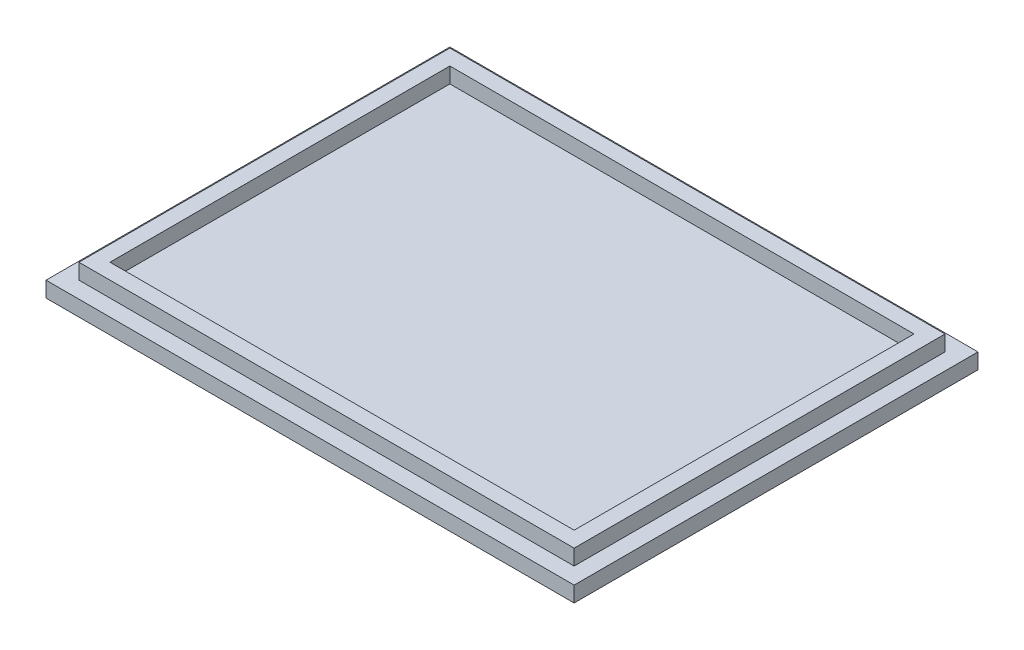
ISO-10303-21;
HEADER;
FILE_DESCRIPTION(('STEP AP214'),'2;1');
FILE_NAME('part.step','',(''),(''),'','','');
FILE_SCHEMA(('AUTOMOTIVE_DESIGN { 1 0 10303 214 1 1 1 1 }'));
ENDSEC;
DATA;
#1=APPLICATION_CONTEXT('core data for automotive mechanical design processes');
#2=APPLICATION_PROTOCOL_DEFINITION('international standard','automotive_design',2000,#1);
#3=PRODUCT_CONTEXT('',#1,'mechanical');
#4=PRODUCT('Part','Part','',(#3));
#5=PRODUCT_RELATED_PRODUCT_CATEGORY('part','',(#4));
#6=PRODUCT_DEFINITION_FORMATION('','',#4);
#7=PRODUCT_DEFINITION_CONTEXT('part definition',#1,'design');
#8=PRODUCT_DEFINITION('design','',#6,#7);
#9=PRODUCT_DEFINITION_SHAPE('','',#8);
#10=(LENGTH_UNIT() NAMED_UNIT(*) SI_UNIT(.MILLI.,.METRE.));
#11=(NAMED_UNIT(*) PLANE_ANGLE_UNIT() SI_UNIT($,.RADIAN.));
#12=(NAMED_UNIT(*) SI_UNIT($,.STERADIAN.) SOLID_ANGLE_UNIT());
#13=UNCERTAINTY_MEASURE_WITH_UNIT(LENGTH_MEASURE(1.E-05),#10,'distance_accuracy_value','');
#14=(GEOMETRIC_REPRESENTATION_CONTEXT(3) GLOBAL_UNCERTAINTY_ASSIGNED_CONTEXT((#13)) GLOBAL_UNIT_ASSIGNED_CONTEXT((#10,
#11,#12)) REPRESENTATION_CONTEXT('',''));
#15=CARTESIAN_POINT('',(0.,0.,0.));
#16=DIRECTION('',(0.,0.,1.));
#17=DIRECTION('',(1.,0.,0.));
#18=AXIS2_PLACEMENT_3D('',#15,#16,#17);
#19=CARTESIAN_POINT('',(0.,5.,0.));
#20=DIRECTION('',(0.,-1.,0.));
#21=DIRECTION('',(0.,0.,-1.));
#22=AXIS2_PLACEMENT_3D('',#19,#20,#21);
#23=PLANE('',#22);
#24=DIRECTION('',(0.,0.,-1.));
#25=VECTOR('',#24,1.);
#26=CARTESIAN_POINT('',(39.85,5.,29.85));
#27=LINE('',#26,#25);
#28=CARTESIAN_POINT('',(39.85,5.,29.85));
#29=VERTEX_POINT('',#28);
#30=CARTESIAN_POINT('',(39.85,5.,-29.85));
#31=VERTEX_POINT('',#30);
#32=EDGE_CURVE('E176',#29,#31,#27,.T.);
#33=ORIENTED_EDGE('',*,*,#32,.T.);
#34=DIRECTION('',(-1.,0.,0.));
#35=VECTOR('',#34,1.);
#36=CARTESIAN_POINT('',(-39.85,5.,-29.85));
#37=LINE('',#36,#35);
#38=CARTESIAN_POINT('',(-39.85,5.,-29.85));
#39=VERTEX_POINT('',#38);
#40=EDGE_CURVE('E180',#31,#39,#37,.T.);
#41=ORIENTED_EDGE('',*,*,#40,.T.);
#42=DIRECTION('',(0.,0.,1.));
#43=VECTOR('',#42,1.);
#44=CARTESIAN_POINT('',(-39.85,5.,29.85));
#45=LINE('',#44,#43);
#46=CARTESIAN_POINT('',(-39.85,5.,29.85));
#47=VERTEX_POINT('',#46);
#48=EDGE_CURVE('E184',#39,#47,#45,.T.);
#49=ORIENTED_EDGE('',*,*,#48,.T.);
#50=DIRECTION('',(1.,0.,0.));
#51=VECTOR('',#50,1.);
#52=CARTESIAN_POINT('',(-39.85,5.,29.85));
#53=LINE('',#52,#51);
#54=EDGE_CURVE('E187',#47,#29,#53,.T.);
#55=ORIENTED_EDGE('',*,*,#54,.T.);
#56=EDGE_LOOP('',(#33,#41,#49,#55));
#57=FACE_BOUND('',#56,.T.);
#58=DIRECTION('',(0.,0.,-1.));
#59=VECTOR('',#58,1.);
#60=CARTESIAN_POINT('',(37.35,5.,0.));
#61=LINE('',#60,#59);
#62=CARTESIAN_POINT('',(37.35,5.,27.35));
#63=VERTEX_POINT('',#62);
#64=CARTESIAN_POINT('',(37.35,5.,-27.35));
#65=VERTEX_POINT('',#64);
#66=EDGE_CURVE('E130',#63,#65,#61,.T.);
#67=ORIENTED_EDGE('',*,*,#66,.F.);
#68=DIRECTION('',(1.,0.,0.));
#69=VECTOR('',#68,1.);
#70=CARTESIAN_POINT('',(0.,5.,27.35));
#71=LINE('',#70,#69);
#72=CARTESIAN_POINT('',(-37.35,5.,27.35));
#73=VERTEX_POINT('',#72);
#74=EDGE_CURVE('E159',#73,#63,#71,.T.);
#75=ORIENTED_EDGE('',*,*,#74,.F.);
#76=DIRECTION('',(0.,0.,1.));
#77=VECTOR('',#76,1.);
#78=CARTESIAN_POINT('',(-37.35,5.,0.));
#79=LINE('',#78,#77);
#80=CARTESIAN_POINT('',(-37.35,5.,-27.35));
#81=VERTEX_POINT('',#80);
#82=EDGE_CURVE('E155',#81,#73,#79,.T.);
#83=ORIENTED_EDGE('',*,*,#82,.F.);
#84=DIRECTION('',(-1.,0.,0.));
#85=VECTOR('',#84,1.);
#86=CARTESIAN_POINT('',(0.,5.,-27.35));
#87=LINE('',#86,#85);
#88=EDGE_CURVE('E141',#65,#81,#87,.T.);
#89=ORIENTED_EDGE('',*,*,#88,.F.);
#90=EDGE_LOOP('',(#67,#75,#83,#89));
#91=FACE_BOUND('',#90,.T.);
#92=ADVANCED_FACE('F39',(#57,#91),#23,.F.);
#93=CARTESIAN_POINT('',(0.,2.5,0.));
#94=DIRECTION('',(0.,-1.,0.));
#95=DIRECTION('',(0.,0.,-1.));
#96=AXIS2_PLACEMENT_3D('',#93,#94,#95);
#97=PLANE('',#96);
#98=DIRECTION('',(0.,0.,-1.));
#99=VECTOR('',#98,1.);
#100=CARTESIAN_POINT('',(42.5,2.5,32.5));
#101=LINE('',#100,#99);
#102=CARTESIAN_POINT('',(42.5,2.5,32.5));
#103=VERTEX_POINT('',#102);
#104=CARTESIAN_POINT('',(42.5,2.5,-32.5));
#105=VERTEX_POINT('',#104);
#106=EDGE_CURVE('E219',#103,#105,#101,.T.);
#107=ORIENTED_EDGE('',*,*,#106,.T.);
#108=DIRECTION('',(-1.,0.,0.));
#109=VECTOR('',#108,1.);
#110=CARTESIAN_POINT('',(-42.5,2.5,-32.5));
#111=LINE('',#110,#109);
#112=CARTESIAN_POINT('',(-42.5,2.5,-32.5));
#113=VERTEX_POINT('',#112);
#114=EDGE_CURVE('E223',#105,#113,#111,.T.);
#115=ORIENTED_EDGE('',*,*,#114,.T.);
#116=DIRECTION('',(0.,0.,1.));
#117=VECTOR('',#116,1.);
#118=CARTESIAN_POINT('',(-42.5,2.5,32.5));
#119=LINE('',#118,#117);
#120=CARTESIAN_POINT('',(-42.5,2.5,32.5));
#121=VERTEX_POINT('',#120);
#122=EDGE_CURVE('E227',#113,#121,#119,.T.);
#123=ORIENTED_EDGE('',*,*,#122,.T.);
#124=DIRECTION('',(1.,0.,0.));
#125=VECTOR('',#124,1.);
#126=CARTESIAN_POINT('',(-42.5,2.5,32.5));
#127=LINE('',#126,#125);
#128=EDGE_CURVE('E230',#121,#103,#127,.T.);
#129=ORIENTED_EDGE('',*,*,#128,.T.);
#130=EDGE_LOOP('',(#107,#115,#123,#129));
#131=FACE_BOUND('',#130,.T.);
#132=DIRECTION('',(0.,0.,-1.));
#133=VECTOR('',#132,1.);
#134=CARTESIAN_POINT('',(39.85,2.5,29.85));
#135=LINE('',#134,#133);
#136=CARTESIAN_POINT('',(39.85,2.5,29.85));
#137=VERTEX_POINT('',#136);
#138=CARTESIAN_POINT('',(39.85,2.5,-29.85));
#139=VERTEX_POINT('',#138);
#140=EDGE_CURVE('E63',#137,#139,#135,.T.);
#141=ORIENTED_EDGE('',*,*,#140,.F.);
#142=DIRECTION('',(1.,0.,0.));
#143=VECTOR('',#142,1.);
#144=CARTESIAN_POINT('',(-39.85,2.5,29.85));
#145=LINE('',#144,#143);
#146=CARTESIAN_POINT('',(-39.85,2.5,29.85));
#147=VERTEX_POINT('',#146);
#148=EDGE_CURVE('E181',#147,#137,#145,.T.);
#149=ORIENTED_EDGE('',*,*,#148,.F.);
#150=DIRECTION('',(0.,0.,1.));
#151=VECTOR('',#150,1.);
#152=CARTESIAN_POINT('',(-39.85,2.5,29.85));
#153=LINE('',#152,#151);
#154=CARTESIAN_POINT('',(-39.85,2.5,-29.85));
#155=VERTEX_POINT('',#154);
#156=EDGE_CURVE('E197',#155,#147,#153,.T.);
#157=ORIENTED_EDGE('',*,*,#156,.F.);
#158=DIRECTION('',(-1.,0.,0.));
#159=VECTOR('',#158,1.);
#160=CARTESIAN_POINT('',(-39.85,2.5,-29.85));
#161=LINE('',#160,#159);
#162=EDGE_CURVE('E193',#139,#155,#161,.T.);
#163=ORIENTED_EDGE('',*,*,#162,.F.);
#164=EDGE_LOOP('',(#141,#149,#157,#163));
#165=FACE_BOUND('',#164,.T.);
#166=ADVANCED_FACE('F272',(#131,#165),#97,.F.);
#167=CARTESIAN_POINT('',(42.5,2.5,32.5));
#168=DIRECTION('',(-1.,0.,0.));
#169=DIRECTION('',(0.,0.,1.));
#170=AXIS2_PLACEMENT_3D('',#167,#168,#169);
#171=PLANE('',#170);
#172=DIRECTION('',(0.,0.,-1.));
#173=VECTOR('',#172,1.);
#174=CARTESIAN_POINT('',(42.5,0.,32.5));
#175=LINE('',#174,#173);
#176=CARTESIAN_POINT('',(42.5,0.,32.5));
#177=VERTEX_POINT('',#176);
#178=CARTESIAN_POINT('',(42.5,0.,-32.5));
#179=VERTEX_POINT('',#178);
#180=EDGE_CURVE('E218',#177,#179,#175,.T.);
#181=ORIENTED_EDGE('',*,*,#180,.T.);
#182=DIRECTION('',(0.,-1.,0.));
#183=VECTOR('',#182,1.);
#184=CARTESIAN_POINT('',(42.5,2.5,-32.5));
#185=LINE('',#184,#183);
#186=EDGE_CURVE('E11',#105,#179,#185,.T.);
#187=ORIENTED_EDGE('',*,*,#186,.F.);
#188=ORIENTED_EDGE('',*,*,#106,.F.);
#189=DIRECTION('',(0.,-1.,0.));
#190=VECTOR('',#189,1.);
#191=CARTESIAN_POINT('',(42.5,2.5,32.5));
#192=LINE('',#191,#190);
#193=EDGE_CURVE('E233',#103,#177,#192,.T.);
#194=ORIENTED_EDGE('',*,*,#193,.T.);
#195=EDGE_LOOP('',(#181,#187,#188,#194));
#196=FACE_BOUND('',#195,.T.);
#197=ADVANCED_FACE('F41',(#196),#171,.F.);
#198=CARTESIAN_POINT('',(-42.5,2.5,-32.5));
#199=DIRECTION('',(0.,0.,1.));
#200=DIRECTION('',(1.,0.,0.));
#201=AXIS2_PLACEMENT_3D('',#198,#199,#200);
#202=PLANE('',#201);
#203=DIRECTION('',(-1.,0.,0.));
#204=VECTOR('',#203,1.);
#205=CARTESIAN_POINT('',(-42.5,0.,-32.5));
#206=LINE('',#205,#204);
#207=CARTESIAN_POINT('',(-42.5,0.,-32.5));
#208=VERTEX_POINT('',#207);
#209=EDGE_CURVE('E237',#179,#208,#206,.T.);
#210=ORIENTED_EDGE('',*,*,#209,.T.);
#211=DIRECTION('',(0.,-1.,0.));
#212=VECTOR('',#211,1.);
#213=CARTESIAN_POINT('',(-42.5,2.5,-32.5));
#214=LINE('',#213,#212);
#215=EDGE_CURVE('E48',#113,#208,#214,.T.);
#216=ORIENTED_EDGE('',*,*,#215,.F.);
#217=ORIENTED_EDGE('',*,*,#114,.F.);
#218=ORIENTED_EDGE('',*,*,#186,.T.);
#219=EDGE_LOOP('',(#210,#216,#217,#218));
#220=FACE_BOUND('',#219,.T.);
#221=ADVANCED_FACE('F273',(#220),#202,.F.);
#222=CARTESIAN_POINT('',(-42.5,2.5,32.5));
#223=DIRECTION('',(1.,0.,0.));
#224=DIRECTION('',(0.,0.,-1.));
#225=AXIS2_PLACEMENT_3D('',#222,#223,#224);
#226=PLANE('',#225);
#227=DIRECTION('',(0.,0.,1.));
#228=VECTOR('',#227,1.);
#229=CARTESIAN_POINT('',(-42.5,0.,32.5));
#230=LINE('',#229,#228);
#231=CARTESIAN_POINT('',(-42.5,0.,32.5));
#232=VERTEX_POINT('',#231);
#233=EDGE_CURVE('E240',#208,#232,#230,.T.);
#234=ORIENTED_EDGE('',*,*,#233,.T.);
#235=DIRECTION('',(0.,-1.,0.));
#236=VECTOR('',#235,1.);
#237=CARTESIAN_POINT('',(-42.5,2.5,32.5));
#238=LINE('',#237,#236);
#239=EDGE_CURVE('E248',#121,#232,#238,.T.);
#240=ORIENTED_EDGE('',*,*,#239,.F.);
#241=ORIENTED_EDGE('',*,*,#122,.F.);
#242=ORIENTED_EDGE('',*,*,#215,.T.);
#243=EDGE_LOOP('',(#234,#240,#241,#242));
#244=FACE_BOUND('',#243,.T.);
#245=ADVANCED_FACE('F257',(#244),#226,.F.);
#246=CARTESIAN_POINT('',(-42.5,2.5,32.5));
#247=DIRECTION('',(0.,0.,-1.));
#248=DIRECTION('',(-1.,0.,0.));
#249=AXIS2_PLACEMENT_3D('',#246,#247,#248);
#250=PLANE('',#249);
#251=DIRECTION('',(1.,0.,0.));
#252=VECTOR('',#251,1.);
#253=CARTESIAN_POINT('',(-42.5,0.,32.5));
#254=LINE('',#253,#252);
#255=EDGE_CURVE('E224',#232,#177,#254,.T.);
#256=ORIENTED_EDGE('',*,*,#255,.T.);
#257=ORIENTED_EDGE('',*,*,#193,.F.);
#258=ORIENTED_EDGE('',*,*,#128,.F.);
#259=ORIENTED_EDGE('',*,*,#239,.T.);
#260=EDGE_LOOP('',(#256,#257,#258,#259));
#261=FACE_BOUND('',#260,.T.);
#262=ADVANCED_FACE('F266',(#261),#250,.F.);
#263=CARTESIAN_POINT('',(0.,0.,0.));
#264=DIRECTION('',(0.,-1.,0.));
#265=DIRECTION('',(0.,0.,-1.));
#266=AXIS2_PLACEMENT_3D('',#263,#264,#265);
#267=PLANE('',#266);
#268=ORIENTED_EDGE('',*,*,#180,.F.);
#269=ORIENTED_EDGE('',*,*,#255,.F.);
#270=ORIENTED_EDGE('',*,*,#233,.F.);
#271=ORIENTED_EDGE('',*,*,#209,.F.);
#272=EDGE_LOOP('',(#268,#269,#270,#271));
#273=FACE_BOUND('',#272,.T.);
#274=ADVANCED_FACE('F263',(#273),#267,.T.);
#275=CARTESIAN_POINT('',(39.85,5.,29.85));
#276=DIRECTION('',(-1.,0.,0.));
#277=DIRECTION('',(0.,0.,1.));
#278=AXIS2_PLACEMENT_3D('',#275,#276,#277);
#279=PLANE('',#278);
#280=ORIENTED_EDGE('',*,*,#140,.T.);
#281=DIRECTION('',(0.,-1.,0.));
#282=VECTOR('',#281,1.);
#283=CARTESIAN_POINT('',(39.85,5.,-29.85));
#284=LINE('',#283,#282);
#285=EDGE_CURVE('E214',#31,#139,#284,.T.);
#286=ORIENTED_EDGE('',*,*,#285,.F.);
#287=ORIENTED_EDGE('',*,*,#32,.F.);
#288=DIRECTION('',(0.,-1.,0.));
#289=VECTOR('',#288,1.);
#290=CARTESIAN_POINT('',(39.85,5.,29.85));
#291=LINE('',#290,#289);
#292=EDGE_CURVE('E190',#29,#137,#291,.T.);
#293=ORIENTED_EDGE('',*,*,#292,.T.);
#294=EDGE_LOOP('',(#280,#286,#287,#293));
#295=FACE_BOUND('',#294,.T.);
#296=ADVANCED_FACE('F302',(#295),#279,.F.);
#297=CARTESIAN_POINT('',(-39.85,5.,-29.85));
#298=DIRECTION('',(0.,0.,1.));
#299=DIRECTION('',(1.,0.,0.));
#300=AXIS2_PLACEMENT_3D('',#297,#298,#299);
#301=PLANE('',#300);
#302=ORIENTED_EDGE('',*,*,#162,.T.);
#303=DIRECTION('',(0.,-1.,0.));
#304=VECTOR('',#303,1.);
#305=CARTESIAN_POINT('',(-39.85,5.,-29.85));
#306=LINE('',#305,#304);
#307=EDGE_CURVE('E210',#39,#155,#306,.T.);
#308=ORIENTED_EDGE('',*,*,#307,.F.);
#309=ORIENTED_EDGE('',*,*,#40,.F.);
#310=ORIENTED_EDGE('',*,*,#285,.T.);
#311=EDGE_LOOP('',(#302,#308,#309,#310));
#312=FACE_BOUND('',#311,.T.);
#313=ADVANCED_FACE('F298',(#312),#301,.F.);
#314=CARTESIAN_POINT('',(-39.85,5.,29.85));
#315=DIRECTION('',(1.,0.,0.));
#316=DIRECTION('',(0.,0.,-1.));
#317=AXIS2_PLACEMENT_3D('',#314,#315,#316);
#318=PLANE('',#317);
#319=ORIENTED_EDGE('',*,*,#156,.T.);
#320=DIRECTION('',(0.,-1.,0.));
#321=VECTOR('',#320,1.);
#322=CARTESIAN_POINT('',(-39.85,5.,29.85));
#323=LINE('',#322,#321);
#324=EDGE_CURVE('E206',#47,#147,#323,.T.);
#325=ORIENTED_EDGE('',*,*,#324,.F.);
#326=ORIENTED_EDGE('',*,*,#48,.F.);
#327=ORIENTED_EDGE('',*,*,#307,.T.);
#328=EDGE_LOOP('',(#319,#325,#326,#327));
#329=FACE_BOUND('',#328,.T.);
#330=ADVANCED_FACE('F294',(#329),#318,.F.);
#331=CARTESIAN_POINT('',(-39.85,5.,29.85));
#332=DIRECTION('',(0.,0.,-1.));
#333=DIRECTION('',(-1.,0.,0.));
#334=AXIS2_PLACEMENT_3D('',#331,#332,#333);
#335=PLANE('',#334);
#336=ORIENTED_EDGE('',*,*,#148,.T.);
#337=ORIENTED_EDGE('',*,*,#292,.F.);
#338=ORIENTED_EDGE('',*,*,#54,.F.);
#339=ORIENTED_EDGE('',*,*,#324,.T.);
#340=EDGE_LOOP('',(#336,#337,#338,#339));
#341=FACE_BOUND('',#340,.T.);
#342=ADVANCED_FACE('F291',(#341),#335,.F.);
#343=CARTESIAN_POINT('',(-39.85,5.,-27.35));
#344=DIRECTION('',(0.,0.,1.));
#345=DIRECTION('',(1.,0.,0.));
#346=AXIS2_PLACEMENT_3D('',#343,#344,#345);
#347=PLANE('',#346);
#348=DIRECTION('',(0.,-1.,0.));
#349=VECTOR('',#348,1.);
#350=CARTESIAN_POINT('',(37.35,5.,-27.35));
#351=LINE('',#350,#349);
#352=CARTESIAN_POINT('',(37.35,2.5,-27.35));
#353=VERTEX_POINT('',#352);
#354=EDGE_CURVE('E134',#65,#353,#351,.T.);
#355=ORIENTED_EDGE('',*,*,#354,.F.);
#356=ORIENTED_EDGE('',*,*,#88,.T.);
#357=DIRECTION('',(0.,-1.,0.));
#358=VECTOR('',#357,1.);
#359=CARTESIAN_POINT('',(-37.35,5.,-27.35));
#360=LINE('',#359,#358);
#361=CARTESIAN_POINT('',(-37.35,2.5,-27.35));
#362=VERTEX_POINT('',#361);
#363=EDGE_CURVE('E152',#81,#362,#360,.T.);
#364=ORIENTED_EDGE('',*,*,#363,.T.);
#365=DIRECTION('',(-1.,0.,0.));
#366=VECTOR('',#365,1.);
#367=CARTESIAN_POINT('',(0.,2.5,-27.35));
#368=LINE('',#367,#366);
#369=EDGE_CURVE('E148',#353,#362,#368,.T.);
#370=ORIENTED_EDGE('',*,*,#369,.F.);
#371=EDGE_LOOP('',(#355,#356,#364,#370));
#372=FACE_BOUND('',#371,.T.);
#373=ADVANCED_FACE('F144',(#372),#347,.T.);
#374=CARTESIAN_POINT('',(-37.35,5.,29.85));
#375=DIRECTION('',(1.,0.,0.));
#376=DIRECTION('',(0.,0.,-1.));
#377=AXIS2_PLACEMENT_3D('',#374,#375,#376);
#378=PLANE('',#377);
#379=ORIENTED_EDGE('',*,*,#363,.F.);
#380=ORIENTED_EDGE('',*,*,#82,.T.);
#381=DIRECTION('',(0.,-1.,0.));
#382=VECTOR('',#381,1.);
#383=CARTESIAN_POINT('',(-37.35,5.,27.35));
#384=LINE('',#383,#382);
#385=CARTESIAN_POINT('',(-37.35,2.5,27.35));
#386=VERTEX_POINT('',#385);
#387=EDGE_CURVE('E55',#73,#386,#384,.T.);
#388=ORIENTED_EDGE('',*,*,#387,.T.);
#389=DIRECTION('',(0.,0.,1.));
#390=VECTOR('',#389,1.);
#391=CARTESIAN_POINT('',(-37.35,2.5,0.));
#392=LINE('',#391,#390);
#393=EDGE_CURVE('E170',#362,#386,#392,.T.);
#394=ORIENTED_EDGE('',*,*,#393,.F.);
#395=EDGE_LOOP('',(#379,#380,#388,#394));
#396=FACE_BOUND('',#395,.T.);
#397=ADVANCED_FACE('F341',(#396),#378,.T.);
#398=CARTESIAN_POINT('',(-39.85,5.,27.35));
#399=DIRECTION('',(0.,0.,-1.));
#400=DIRECTION('',(-1.,0.,0.));
#401=AXIS2_PLACEMENT_3D('',#398,#399,#400);
#402=PLANE('',#401);
#403=ORIENTED_EDGE('',*,*,#387,.F.);
#404=ORIENTED_EDGE('',*,*,#74,.T.);
#405=DIRECTION('',(0.,-1.,0.));
#406=VECTOR('',#405,1.);
#407=CARTESIAN_POINT('',(37.35,5.,27.35));
#408=LINE('',#407,#406);
#409=CARTESIAN_POINT('',(37.35,2.5,27.35));
#410=VERTEX_POINT('',#409);
#411=EDGE_CURVE('E136',#63,#410,#408,.T.);
#412=ORIENTED_EDGE('',*,*,#411,.T.);
#413=DIRECTION('',(1.,0.,0.));
#414=VECTOR('',#413,1.);
#415=CARTESIAN_POINT('',(0.,2.5,27.35));
#416=LINE('',#415,#414);
#417=EDGE_CURVE('E167',#386,#410,#416,.T.);
#418=ORIENTED_EDGE('',*,*,#417,.F.);
#419=EDGE_LOOP('',(#403,#404,#412,#418));
#420=FACE_BOUND('',#419,.T.);
#421=ADVANCED_FACE('F289',(#420),#402,.T.);
#422=CARTESIAN_POINT('',(37.35,5.,29.85));
#423=DIRECTION('',(-1.,0.,0.));
#424=DIRECTION('',(0.,0.,1.));
#425=AXIS2_PLACEMENT_3D('',#422,#423,#424);
#426=PLANE('',#425);
#427=ORIENTED_EDGE('',*,*,#411,.F.);
#428=ORIENTED_EDGE('',*,*,#66,.T.);
#429=ORIENTED_EDGE('',*,*,#354,.T.);
#430=DIRECTION('',(0.,0.,-1.));
#431=VECTOR('',#430,1.);
#432=CARTESIAN_POINT('',(37.35,2.5,0.));
#433=LINE('',#432,#431);
#434=EDGE_CURVE('E151',#410,#353,#433,.T.);
#435=ORIENTED_EDGE('',*,*,#434,.F.);
#436=EDGE_LOOP('',(#427,#428,#429,#435));
#437=FACE_BOUND('',#436,.T.);
#438=ADVANCED_FACE('F132',(#437),#426,.T.);
#439=CARTESIAN_POINT('',(0.,2.5,0.));
#440=DIRECTION('',(0.,-1.,0.));
#441=DIRECTION('',(0.,0.,-1.));
#442=AXIS2_PLACEMENT_3D('',#439,#440,#441);
#443=PLANE('',#442);
#444=ORIENTED_EDGE('',*,*,#369,.T.);
#445=ORIENTED_EDGE('',*,*,#393,.T.);
#446=ORIENTED_EDGE('',*,*,#417,.T.);
#447=ORIENTED_EDGE('',*,*,#434,.T.);
#448=EDGE_LOOP('',(#444,#445,#446,#447));
#449=FACE_BOUND('',#448,.T.);
#450=ADVANCED_FACE('F359',(#449),#443,.F.);
#451=CLOSED_SHELL('',(#92,#166,#197,#221,#245,#262,#274,#296,#313,#330,#342,#373,#397,#421,#438,#450));
#452=MANIFOLD_SOLID_BREP('B2',#451);
#453=ADVANCED_BREP_SHAPE_REPRESENTATION('',(#18,#452),#14);
#454=SHAPE_DEFINITION_REPRESENTATION(#9,#453);
ENDSEC;
END-ISO-10303-21;
